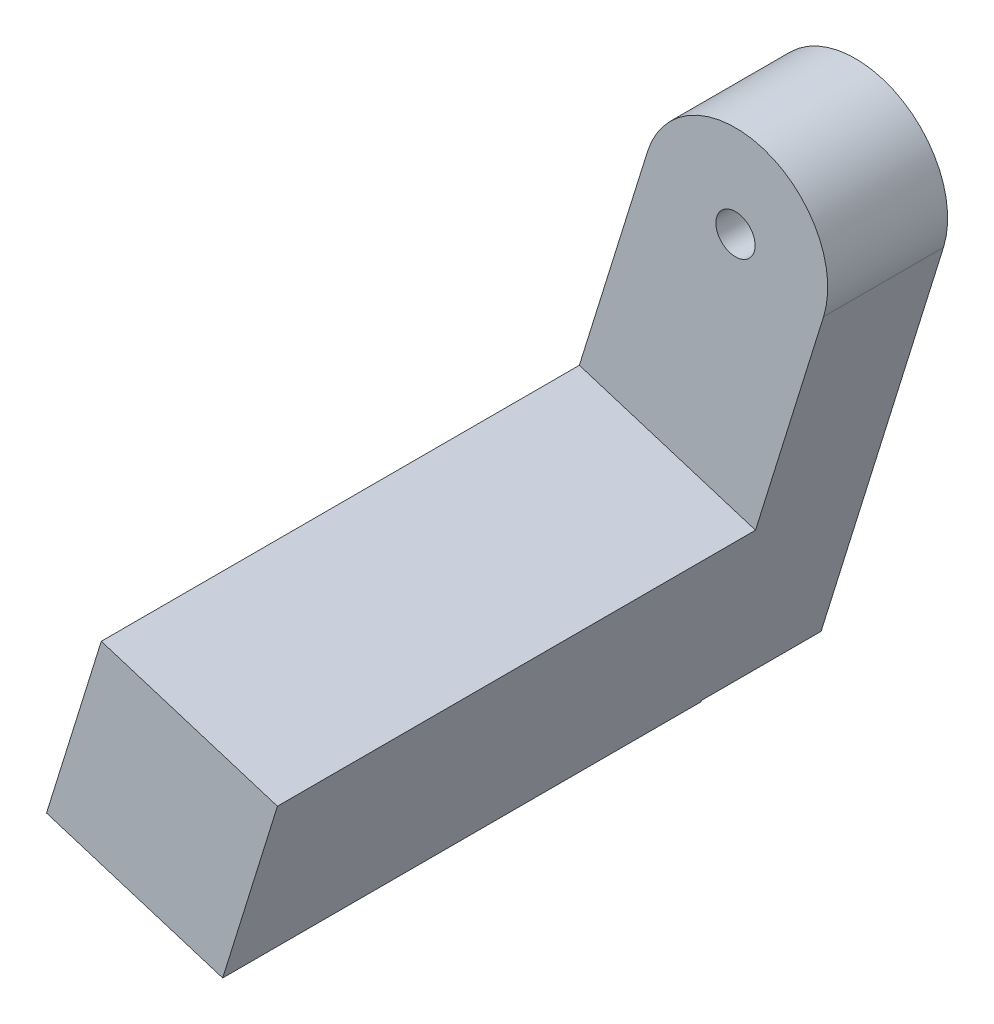
ISO-10303-21;
HEADER;
FILE_DESCRIPTION(('STEP AP214'),'2;1');
FILE_NAME('part.step','',(''),(''),'','','');
FILE_SCHEMA(('AUTOMOTIVE_DESIGN { 1 0 10303 214 1 1 1 1 }'));
ENDSEC;
DATA;
#1=APPLICATION_CONTEXT('core data for automotive mechanical design processes');
#2=APPLICATION_PROTOCOL_DEFINITION('international standard','automotive_design',2000,#1);
#3=PRODUCT_CONTEXT('',#1,'mechanical');
#4=PRODUCT('Part','Part','',(#3));
#5=PRODUCT_RELATED_PRODUCT_CATEGORY('part','',(#4));
#6=PRODUCT_DEFINITION_FORMATION('','',#4);
#7=PRODUCT_DEFINITION_CONTEXT('part definition',#1,'design');
#8=PRODUCT_DEFINITION('design','',#6,#7);
#9=PRODUCT_DEFINITION_SHAPE('','',#8);
#10=(LENGTH_UNIT() NAMED_UNIT(*) SI_UNIT(.MILLI.,.METRE.));
#11=(NAMED_UNIT(*) PLANE_ANGLE_UNIT() SI_UNIT($,.RADIAN.));
#12=(NAMED_UNIT(*) SI_UNIT($,.STERADIAN.) SOLID_ANGLE_UNIT());
#13=UNCERTAINTY_MEASURE_WITH_UNIT(LENGTH_MEASURE(1.E-05),#10,'distance_accuracy_value','');
#14=(GEOMETRIC_REPRESENTATION_CONTEXT(3) GLOBAL_UNCERTAINTY_ASSIGNED_CONTEXT((#13)) GLOBAL_UNIT_ASSIGNED_CONTEXT((#10,
#11,#12)) REPRESENTATION_CONTEXT('',''));
#15=CARTESIAN_POINT('',(0.,0.,0.));
#16=DIRECTION('',(0.,0.,1.));
#17=DIRECTION('',(1.,0.,0.));
#18=AXIS2_PLACEMENT_3D('',#15,#16,#17);
#19=CARTESIAN_POINT('',(-3.81965194648471,1.18754326561838,2.));
#20=DIRECTION('',(0.296885816404479,0.954912986621214,0.));
#21=DIRECTION('',(-0.954912986621214,0.296885816404479,0.));
#22=AXIS2_PLACEMENT_3D('',#19,#20,#21);
#23=PLANE('',#22);
#24=DIRECTION('',(-0.954912986621214,0.296885816404479,0.));
#25=VECTOR('',#24,1.);
#26=CARTESIAN_POINT('',(0.,0.,0.));
#27=LINE('',#26,#25);
#28=CARTESIAN_POINT('',(-0.811676038627886,0.252352943944275,0.));
#29=VERTEX_POINT('',#28);
#30=CARTESIAN_POINT('',(-2.19629986922879,0.6828373777303,0.));
#31=VERTEX_POINT('',#30);
#32=EDGE_CURVE('E133',#29,#31,#27,.T.);
#33=ORIENTED_EDGE('',*,*,#32,.F.);
#34=DIRECTION('',(0.954912986621214,-0.296885816404479,0.));
#35=VECTOR('',#34,1.);
#36=CARTESIAN_POINT('',(-3.81965194648471,1.18754326561838,0.));
#37=LINE('',#36,#35);
#38=CARTESIAN_POINT('',(0.811676038628177,-0.252352943943339,0.));
#39=VERTEX_POINT('',#38);
#40=EDGE_CURVE('E11',#29,#39,#37,.T.);
#41=ORIENTED_EDGE('',*,*,#40,.T.);
#42=CARTESIAN_POINT('',(2.19629986922879,-0.6828373777303,0.));
#43=VERTEX_POINT('',#42);
#44=EDGE_CURVE('E134',#43,#39,#27,.T.);
#45=ORIENTED_EDGE('',*,*,#44,.F.);
#46=DIRECTION('',(0.,0.,1.));
#47=VECTOR('',#46,1.);
#48=CARTESIAN_POINT('',(2.19629986922894,-0.682837377729831,-14.5137084989829));
#49=LINE('',#48,#47);
#50=CARTESIAN_POINT('',(2.19629986925344,-0.682837377737451,-3.19999999999832));
#51=VERTEX_POINT('',#50);
#52=EDGE_CURVE('E136',#51,#43,#49,.T.);
#53=ORIENTED_EDGE('',*,*,#52,.F.);
#54=DIRECTION('',(0.954912986621214,-0.296885816404479,0.));
#55=VECTOR('',#54,1.);
#56=CARTESIAN_POINT('',(-3.81965194648471,1.18754326561838,-3.19999999999755));
#57=LINE('',#56,#55);
#58=CARTESIAN_POINT('',(-2.19629986920415,0.68283737772315,-3.19999999999804));
#59=VERTEX_POINT('',#58);
#60=EDGE_CURVE('E139',#59,#51,#57,.T.);
#61=ORIENTED_EDGE('',*,*,#60,.F.);
#62=DIRECTION('',(0.,0.,1.));
#63=VECTOR('',#62,1.);
#64=CARTESIAN_POINT('',(-2.19629986922865,0.682837377730769,-14.5137084989829));
#65=LINE('',#64,#63);
#66=EDGE_CURVE('E56',#31,#59,#65,.F.);
#67=ORIENTED_EDGE('',*,*,#66,.F.);
#68=EDGE_LOOP('',(#33,#41,#45,#53,#61,#67));
#69=FACE_BOUND('',#68,.T.);
#70=ADVANCED_FACE('F37',(#69),#23,.T.);
#71=CARTESIAN_POINT('',(0.,0.,-14.5137084989829));
#72=DIRECTION('',(0.,0.,1.));
#73=DIRECTION('',(1.,0.,0.));
#74=AXIS2_PLACEMENT_3D('',#71,#72,#73);
#75=CYLINDRICAL_SURFACE('',#74,4.);
#76=DIRECTION('',(0.,0.,1.));
#77=VECTOR('',#76,1.);
#78=CARTESIAN_POINT('',(-3.81965194648471,1.18754326561838,2.));
#79=LINE('',#78,#77);
#80=CARTESIAN_POINT('',(-3.81965194648471,1.18754326561838,-3.19999999999755));
#81=VERTEX_POINT('',#80);
#82=CARTESIAN_POINT('',(-3.81965194648471,1.18754326561838,2.));
#83=VERTEX_POINT('',#82);
#84=EDGE_CURVE('E175',#81,#83,#79,.T.);
#85=ORIENTED_EDGE('',*,*,#84,.T.);
#86=CARTESIAN_POINT('',(0.,0.,2.));
#87=DIRECTION('',(0.,0.,1.));
#88=DIRECTION('',(1.,0.,0.));
#89=AXIS2_PLACEMENT_3D('',#86,#87,#88);
#90=CIRCLE('',#89,4.);
#91=CARTESIAN_POINT('',(3.819651946485,-1.18754326561745,2.));
#92=VERTEX_POINT('',#91);
#93=EDGE_CURVE('E149',#92,#83,#90,.T.);
#94=ORIENTED_EDGE('',*,*,#93,.F.);
#95=DIRECTION('',(0.,0.,1.));
#96=VECTOR('',#95,1.);
#97=CARTESIAN_POINT('',(3.819651946485,-1.18754326561745,2.));
#98=LINE('',#97,#96);
#99=CARTESIAN_POINT('',(3.81965194648486,-1.18754326561791,-3.19999999999843));
#100=VERTEX_POINT('',#99);
#101=EDGE_CURVE('E177',#100,#92,#98,.T.);
#102=ORIENTED_EDGE('',*,*,#101,.F.);
#103=CARTESIAN_POINT('',(0.,0.,-3.19999999999819));
#104=DIRECTION('',(1.0538286023532E-13,1.33842857646129E-13,1.));
#105=DIRECTION('',(0.,-1.,1.33842857646129E-13));
#106=AXIS2_PLACEMENT_3D('',#103,#104,#105);
#107=CIRCLE('',#106,4.);
#108=EDGE_CURVE('E156',#81,#100,#107,.F.);
#109=ORIENTED_EDGE('',*,*,#108,.F.);
#110=EDGE_LOOP('',(#85,#94,#102,#109));
#111=FACE_BOUND('',#110,.T.);
#112=ADVANCED_FACE('F39',(#111),#75,.T.);
#113=CARTESIAN_POINT('',(0.,0.,-14.5137084989829));
#114=DIRECTION('',(0.,0.,1.));
#115=DIRECTION('',(1.,0.,0.));
#116=AXIS2_PLACEMENT_3D('',#113,#114,#115);
#117=CYLINDRICAL_SURFACE('',#116,2.3);
#118=CARTESIAN_POINT('',(0.,0.,0.));
#119=DIRECTION('',(0.,0.,1.));
#120=DIRECTION('',(1.,0.,0.));
#121=AXIS2_PLACEMENT_3D('',#118,#119,#120);
#122=CIRCLE('',#121,2.3);
#123=EDGE_CURVE('E153',#43,#31,#122,.T.);
#124=ORIENTED_EDGE('',*,*,#123,.T.);
#125=ORIENTED_EDGE('',*,*,#66,.T.);
#126=CARTESIAN_POINT('',(4.53526105559376E-11,5.94515756069391E-11,-3.19999999999818));
#127=DIRECTION('',(1.0538286023532E-13,1.33842857646129E-13,1.));
#128=DIRECTION('',(-0.954912986621214,0.296885816404478,0.));
#129=AXIS2_PLACEMENT_3D('',#126,#127,#128);
#130=CIRCLE('',#129,2.3);
#131=EDGE_CURVE('E45',#51,#59,#130,.T.);
#132=ORIENTED_EDGE('',*,*,#131,.F.);
#133=ORIENTED_EDGE('',*,*,#52,.T.);
#134=EDGE_LOOP('',(#124,#125,#132,#133));
#135=FACE_BOUND('',#134,.T.);
#136=ADVANCED_FACE('F158',(#135),#117,.F.);
#137=CARTESIAN_POINT('',(-2.61259518431406,-8.40323428220723,-3.19999999999679));
#138=DIRECTION('',(1.0538286023532E-13,1.33842857646129E-13,1.));
#139=DIRECTION('',(-0.954912986621214,0.296885816404478,0.));
#140=AXIS2_PLACEMENT_3D('',#137,#138,#139);
#141=PLANE('',#140);
#142=ORIENTED_EDGE('',*,*,#131,.T.);
#143=ORIENTED_EDGE('',*,*,#60,.T.);
#144=EDGE_LOOP('',(#142,#143));
#145=FACE_BOUND('',#144,.T.);
#146=ORIENTED_EDGE('',*,*,#108,.T.);
#147=DIRECTION('',(0.296885816404479,0.954912986621214,0.));
#148=VECTOR('',#147,1.);
#149=CARTESIAN_POINT('',(3.819651946485,-1.18754326561745,-3.19999999999755));
#150=LINE('',#149,#148);
#151=CARTESIAN_POINT('',(-1.488336473406,-18.2603261165279,-3.19999999999755));
#152=VERTEX_POINT('',#151);
#153=EDGE_CURVE('E166',#152,#100,#150,.T.);
#154=ORIENTED_EDGE('',*,*,#153,.F.);
#155=DIRECTION('',(0.954912986621214,-0.296885816404479,0.));
#156=VECTOR('',#155,1.);
#157=CARTESIAN_POINT('',(-9.12764036637571,-15.8852395852921,-3.19999999999755));
#158=LINE('',#157,#156);
#159=CARTESIAN_POINT('',(-9.12764036637571,-15.8852395852921,-3.19999999999755));
#160=VERTEX_POINT('',#159);
#161=EDGE_CURVE('E143',#160,#152,#158,.T.);
#162=ORIENTED_EDGE('',*,*,#161,.F.);
#163=DIRECTION('',(0.296885816404479,0.954912986621214,0.));
#164=VECTOR('',#163,1.);
#165=CARTESIAN_POINT('',(-3.81965194648471,1.18754326561838,-3.19999999999755));
#166=LINE('',#165,#164);
#167=EDGE_CURVE('E169',#160,#81,#166,.T.);
#168=ORIENTED_EDGE('',*,*,#167,.T.);
#169=EDGE_LOOP('',(#146,#154,#162,#168));
#170=FACE_BOUND('',#169,.T.);
#171=ADVANCED_FACE('F160',(#145,#170),#141,.F.);
#172=CARTESIAN_POINT('',(0.,0.,0.));
#173=DIRECTION('',(0.,0.,1.));
#174=DIRECTION('',(1.,0.,0.));
#175=AXIS2_PLACEMENT_3D('',#172,#173,#174);
#176=PLANE('',#175);
#177=ORIENTED_EDGE('',*,*,#123,.F.);
#178=ORIENTED_EDGE('',*,*,#44,.T.);
#179=CARTESIAN_POINT('',(0.,0.,0.));
#180=DIRECTION('',(0.,0.,1.));
#181=DIRECTION('',(1.,0.,0.));
#182=AXIS2_PLACEMENT_3D('',#179,#180,#181);
#183=CIRCLE('',#182,0.85);
#184=EDGE_CURVE('E127',#39,#29,#183,.T.);
#185=ORIENTED_EDGE('',*,*,#184,.T.);
#186=ORIENTED_EDGE('',*,*,#32,.T.);
#187=EDGE_LOOP('',(#177,#178,#185,#186));
#188=FACE_BOUND('',#187,.T.);
#189=ADVANCED_FACE('F132',(#188),#176,.F.);
#190=CARTESIAN_POINT('',(0.,0.,2.));
#191=DIRECTION('',(0.,0.,1.));
#192=DIRECTION('',(1.,0.,0.));
#193=AXIS2_PLACEMENT_3D('',#190,#191,#192);
#194=PLANE('',#193);
#195=CARTESIAN_POINT('',(0.,0.,2.));
#196=DIRECTION('',(0.,0.,1.));
#197=DIRECTION('',(1.,0.,0.));
#198=AXIS2_PLACEMENT_3D('',#195,#196,#197);
#199=CIRCLE('',#198,0.85);
#200=CARTESIAN_POINT('',(0.85,0.,2.));
#201=VERTEX_POINT('',#200);
#202=EDGE_CURVE('E135',#201,#201,#199,.T.);
#203=ORIENTED_EDGE('',*,*,#202,.F.);
#204=EDGE_LOOP('',(#203));
#205=FACE_BOUND('',#204,.T.);
#206=ORIENTED_EDGE('',*,*,#93,.T.);
#207=DIRECTION('',(-0.296885816404479,-0.954912986621214,0.));
#208=VECTOR('',#207,1.);
#209=CARTESIAN_POINT('',(-3.81965194648471,1.18754326561838,2.));
#210=LINE('',#209,#208);
#211=CARTESIAN_POINT('',(-6.77198414551986,-8.30843196088996,2.));
#212=VERTEX_POINT('',#211);
#213=EDGE_CURVE('E180',#83,#212,#210,.T.);
#214=ORIENTED_EDGE('',*,*,#213,.T.);
#215=DIRECTION('',(0.954912986621214,-0.296885816404479,0.));
#216=VECTOR('',#215,1.);
#217=CARTESIAN_POINT('',(-6.77198414551986,-8.30843196088996,2.));
#218=LINE('',#217,#216);
#219=CARTESIAN_POINT('',(0.86731974744985,-10.6835184921258,2.));
#220=VERTEX_POINT('',#219);
#221=EDGE_CURVE('E197',#212,#220,#218,.T.);
#222=ORIENTED_EDGE('',*,*,#221,.T.);
#223=DIRECTION('',(-0.296885816404479,-0.954912986621214,0.));
#224=VECTOR('',#223,1.);
#225=CARTESIAN_POINT('',(3.819651946485,-1.18754326561745,2.));
#226=LINE('',#225,#224);
#227=EDGE_CURVE('E128',#92,#220,#226,.T.);
#228=ORIENTED_EDGE('',*,*,#227,.F.);
#229=EDGE_LOOP('',(#206,#214,#222,#228));
#230=FACE_BOUND('',#229,.T.);
#231=ADVANCED_FACE('F231',(#205,#230),#194,.T.);
#232=CARTESIAN_POINT('',(0.,0.,2.));
#233=DIRECTION('',(0.,0.,-1.));
#234=DIRECTION('',(-1.,0.,0.));
#235=AXIS2_PLACEMENT_3D('',#232,#233,#234);
#236=CYLINDRICAL_SURFACE('',#235,0.85);
#237=ORIENTED_EDGE('',*,*,#202,.T.);
#238=EDGE_LOOP('',(#237));
#239=FACE_BOUND('',#238,.T.);
#240=ORIENTED_EDGE('',*,*,#184,.F.);
#241=CARTESIAN_POINT('',(0.,0.,0.));
#242=DIRECTION('',(0.,0.,1.));
#243=DIRECTION('',(1.,0.,0.));
#244=AXIS2_PLACEMENT_3D('',#241,#242,#243);
#245=CIRCLE('',#244,0.85);
#246=EDGE_CURVE('E118',#29,#39,#245,.T.);
#247=ORIENTED_EDGE('',*,*,#246,.F.);
#248=EDGE_LOOP('',(#240,#247));
#249=FACE_BOUND('',#248,.T.);
#250=ADVANCED_FACE('F126',(#239,#249),#236,.F.);
#251=CARTESIAN_POINT('',(-9.12764036637571,-15.8852395852921,2.));
#252=DIRECTION('',(-0.296885816404479,-0.954912986621214,0.));
#253=DIRECTION('',(0.954912986621214,-0.296885816404479,0.));
#254=AXIS2_PLACEMENT_3D('',#251,#252,#253);
#255=PLANE('',#254);
#256=DIRECTION('',(0.,0.,-1.));
#257=VECTOR('',#256,1.);
#258=CARTESIAN_POINT('',(-1.488336473406,-18.2603261165279,2.));
#259=LINE('',#258,#257);
#260=CARTESIAN_POINT('',(-1.488336473406,-18.2603261165279,2.));
#261=VERTEX_POINT('',#260);
#262=EDGE_CURVE('E185',#261,#152,#259,.T.);
#263=ORIENTED_EDGE('',*,*,#262,.F.);
#264=DIRECTION('',(0.954912986621214,-0.296885816404479,0.));
#265=VECTOR('',#264,1.);
#266=CARTESIAN_POINT('',(-9.12764036637571,-15.8852395852921,2.));
#267=LINE('',#266,#265);
#268=CARTESIAN_POINT('',(-9.12764036637571,-15.8852395852921,2.));
#269=VERTEX_POINT('',#268);
#270=EDGE_CURVE('E190',#269,#261,#267,.T.);
#271=ORIENTED_EDGE('',*,*,#270,.F.);
#272=DIRECTION('',(0.,0.,-1.));
#273=VECTOR('',#272,1.);
#274=CARTESIAN_POINT('',(-9.12764036637571,-15.8852395852921,2.));
#275=LINE('',#274,#273);
#276=EDGE_CURVE('E201',#269,#160,#275,.T.);
#277=ORIENTED_EDGE('',*,*,#276,.T.);
#278=ORIENTED_EDGE('',*,*,#161,.T.);
#279=EDGE_LOOP('',(#263,#271,#277,#278));
#280=FACE_BOUND('',#279,.T.);
#281=ADVANCED_FACE('F221',(#280),#255,.T.);
#282=CARTESIAN_POINT('',(-9.12764036637571,-15.8852395852921,2.));
#283=DIRECTION('',(0.,0.,-1.));
#284=DIRECTION('',(0.,1.,0.));
#285=AXIS2_PLACEMENT_3D('',#282,#283,#284);
#286=PLANE('',#285);
#287=DIRECTION('',(0.296885816404477,0.954912986621214,0.));
#288=VECTOR('',#287,1.);
#289=CARTESIAN_POINT('',(-1.488336473406,-18.2603261165279,2.));
#290=LINE('',#289,#288);
#291=CARTESIAN_POINT('',(-1.50776678378598,-18.3228223850955,2.));
#292=VERTEX_POINT('',#291);
#293=EDGE_CURVE('E215',#292,#261,#290,.T.);
#294=ORIENTED_EDGE('',*,*,#293,.F.);
#295=DIRECTION('',(0.954912986621214,-0.296885816404479,0.));
#296=VECTOR('',#295,1.);
#297=CARTESIAN_POINT('',(-9.14707067675569,-15.9477358538597,2.));
#298=LINE('',#297,#296);
#299=CARTESIAN_POINT('',(-9.14707067675569,-15.9477358538597,2.));
#300=VERTEX_POINT('',#299);
#301=EDGE_CURVE('E192',#300,#292,#298,.T.);
#302=ORIENTED_EDGE('',*,*,#301,.F.);
#303=DIRECTION('',(0.296885816404477,0.954912986621214,0.));
#304=VECTOR('',#303,1.);
#305=CARTESIAN_POINT('',(-9.12764036637571,-15.8852395852921,2.));
#306=LINE('',#305,#304);
#307=EDGE_CURVE('E247',#300,#269,#306,.T.);
#308=ORIENTED_EDGE('',*,*,#307,.T.);
#309=ORIENTED_EDGE('',*,*,#270,.T.);
#310=EDGE_LOOP('',(#294,#302,#308,#309));
#311=FACE_BOUND('',#310,.T.);
#312=ADVANCED_FACE('F246',(#311),#286,.T.);
#313=CARTESIAN_POINT('',(-9.14707067675569,-15.9477358538597,22.7319132116981));
#314=DIRECTION('',(-0.296885816404479,-0.954912986621214,0.));
#315=DIRECTION('',(0.954912986621214,-0.296885816404479,0.));
#316=AXIS2_PLACEMENT_3D('',#313,#314,#315);
#317=PLANE('',#316);
#318=DIRECTION('',(0.,0.,-1.));
#319=VECTOR('',#318,1.);
#320=CARTESIAN_POINT('',(-1.50776678378598,-18.3228223850955,22.7319132116981));
#321=LINE('',#320,#319);
#322=CARTESIAN_POINT('',(-1.50776678378598,-18.3228223850955,22.7319132116981));
#323=VERTEX_POINT('',#322);
#324=EDGE_CURVE('E212',#323,#292,#321,.T.);
#325=ORIENTED_EDGE('',*,*,#324,.F.);
#326=DIRECTION('',(0.954912986621214,-0.296885816404479,0.));
#327=VECTOR('',#326,1.);
#328=CARTESIAN_POINT('',(-9.14707067675569,-15.9477358538597,22.7319132116981));
#329=LINE('',#328,#327);
#330=CARTESIAN_POINT('',(-9.14707067675569,-15.9477358538597,22.7319132116981));
#331=VERTEX_POINT('',#330);
#332=EDGE_CURVE('E194',#331,#323,#329,.T.);
#333=ORIENTED_EDGE('',*,*,#332,.F.);
#334=DIRECTION('',(0.,0.,-1.));
#335=VECTOR('',#334,1.);
#336=CARTESIAN_POINT('',(-9.14707067675569,-15.9477358538597,22.7319132116981));
#337=LINE('',#336,#335);
#338=EDGE_CURVE('E244',#331,#300,#337,.T.);
#339=ORIENTED_EDGE('',*,*,#338,.T.);
#340=ORIENTED_EDGE('',*,*,#301,.T.);
#341=EDGE_LOOP('',(#325,#333,#339,#340));
#342=FACE_BOUND('',#341,.T.);
#343=ADVANCED_FACE('F243',(#342),#317,.T.);
#344=CARTESIAN_POINT('',(-6.77198414551986,-8.30843196088996,22.7319132116981));
#345=DIRECTION('',(0.,0.,1.));
#346=DIRECTION('',(1.,0.,0.));
#347=AXIS2_PLACEMENT_3D('',#344,#345,#346);
#348=PLANE('',#347);
#349=DIRECTION('',(-0.296885816404479,-0.954912986621214,0.));
#350=VECTOR('',#349,1.);
#351=CARTESIAN_POINT('',(0.86731974744985,-10.6835184921258,22.7319132116981));
#352=LINE('',#351,#350);
#353=CARTESIAN_POINT('',(0.86731974744985,-10.6835184921258,22.7319132116981));
#354=VERTEX_POINT('',#353);
#355=EDGE_CURVE('E209',#354,#323,#352,.T.);
#356=ORIENTED_EDGE('',*,*,#355,.F.);
#357=DIRECTION('',(0.954912986621214,-0.296885816404479,0.));
#358=VECTOR('',#357,1.);
#359=CARTESIAN_POINT('',(-6.77198414551986,-8.30843196088996,22.7319132116981));
#360=LINE('',#359,#358);
#361=CARTESIAN_POINT('',(-6.77198414551986,-8.30843196088996,22.7319132116981));
#362=VERTEX_POINT('',#361);
#363=EDGE_CURVE('E196',#362,#354,#360,.T.);
#364=ORIENTED_EDGE('',*,*,#363,.F.);
#365=DIRECTION('',(-0.296885816404479,-0.954912986621214,0.));
#366=VECTOR('',#365,1.);
#367=CARTESIAN_POINT('',(-6.77198414551986,-8.30843196088996,22.7319132116981));
#368=LINE('',#367,#366);
#369=EDGE_CURVE('E239',#362,#331,#368,.T.);
#370=ORIENTED_EDGE('',*,*,#369,.T.);
#371=ORIENTED_EDGE('',*,*,#332,.T.);
#372=EDGE_LOOP('',(#356,#364,#370,#371));
#373=FACE_BOUND('',#372,.T.);
#374=ADVANCED_FACE('F237',(#373),#348,.T.);
#375=CARTESIAN_POINT('',(-6.77198414551986,-8.30843196088996,22.7319132116981));
#376=DIRECTION('',(0.296885816404479,0.954912986621214,0.));
#377=DIRECTION('',(-0.954912986621214,0.296885816404479,0.));
#378=AXIS2_PLACEMENT_3D('',#375,#376,#377);
#379=PLANE('',#378);
#380=DIRECTION('',(0.,0.,1.));
#381=VECTOR('',#380,1.);
#382=CARTESIAN_POINT('',(0.86731974744985,-10.6835184921258,22.7319132116981));
#383=LINE('',#382,#381);
#384=EDGE_CURVE('E206',#220,#354,#383,.T.);
#385=ORIENTED_EDGE('',*,*,#384,.F.);
#386=ORIENTED_EDGE('',*,*,#221,.F.);
#387=DIRECTION('',(0.,0.,1.));
#388=VECTOR('',#387,1.);
#389=CARTESIAN_POINT('',(-6.77198414551986,-8.30843196088996,22.7319132116981));
#390=LINE('',#389,#388);
#391=EDGE_CURVE('E183',#212,#362,#390,.T.);
#392=ORIENTED_EDGE('',*,*,#391,.T.);
#393=ORIENTED_EDGE('',*,*,#363,.T.);
#394=EDGE_LOOP('',(#385,#386,#392,#393));
#395=FACE_BOUND('',#394,.T.);
#396=ADVANCED_FACE('F234',(#395),#379,.T.);
#397=CARTESIAN_POINT('',(-3.81965194648485,1.18754326561791,0.));
#398=DIRECTION('',(0.954912986621214,-0.296885816404479,0.));
#399=DIRECTION('',(0.296885816404479,0.954912986621214,0.));
#400=AXIS2_PLACEMENT_3D('',#397,#398,#399);
#401=PLANE('',#400);
#402=ORIENTED_EDGE('',*,*,#213,.F.);
#403=ORIENTED_EDGE('',*,*,#84,.F.);
#404=ORIENTED_EDGE('',*,*,#167,.F.);
#405=ORIENTED_EDGE('',*,*,#276,.F.);
#406=ORIENTED_EDGE('',*,*,#307,.F.);
#407=ORIENTED_EDGE('',*,*,#338,.F.);
#408=ORIENTED_EDGE('',*,*,#369,.F.);
#409=ORIENTED_EDGE('',*,*,#391,.F.);
#410=EDGE_LOOP('',(#402,#403,#404,#405,#406,#407,#408,#409));
#411=FACE_BOUND('',#410,.T.);
#412=ADVANCED_FACE('F225',(#411),#401,.F.);
#413=CARTESIAN_POINT('',(3.81965194648486,-1.18754326561791,0.));
#414=DIRECTION('',(0.954912986621214,-0.296885816404479,0.));
#415=DIRECTION('',(0.296885816404479,0.954912986621214,0.));
#416=AXIS2_PLACEMENT_3D('',#413,#414,#415);
#417=PLANE('',#416);
#418=ORIENTED_EDGE('',*,*,#227,.T.);
#419=ORIENTED_EDGE('',*,*,#384,.T.);
#420=ORIENTED_EDGE('',*,*,#355,.T.);
#421=ORIENTED_EDGE('',*,*,#324,.T.);
#422=ORIENTED_EDGE('',*,*,#293,.T.);
#423=ORIENTED_EDGE('',*,*,#262,.T.);
#424=ORIENTED_EDGE('',*,*,#153,.T.);
#425=ORIENTED_EDGE('',*,*,#101,.T.);
#426=EDGE_LOOP('',(#418,#419,#420,#421,#422,#423,#424,#425));
#427=FACE_BOUND('',#426,.T.);
#428=ADVANCED_FACE('F218',(#427),#417,.T.);
#429=CARTESIAN_POINT('',(0.,0.,0.));
#430=DIRECTION('',(0.,0.,1.));
#431=DIRECTION('',(1.,0.,0.));
#432=AXIS2_PLACEMENT_3D('',#429,#430,#431);
#433=PLANE('',#432);
#434=ORIENTED_EDGE('',*,*,#246,.T.);
#435=ORIENTED_EDGE('',*,*,#40,.F.);
#436=EDGE_LOOP('',(#434,#435));
#437=FACE_BOUND('',#436,.T.);
#438=ADVANCED_FACE('F117',(#437),#433,.T.);
#439=CLOSED_SHELL('',(#70,#112,#136,#171,#189,#231,#250,#281,#312,#343,#374,#396,#412,#428,#438));
#440=MANIFOLD_SOLID_BREP('B2',#439);
#441=ADVANCED_BREP_SHAPE_REPRESENTATION('',(#18,#440),#14);
#442=SHAPE_DEFINITION_REPRESENTATION(#9,#441);
ENDSEC;
END-ISO-10303-21;
